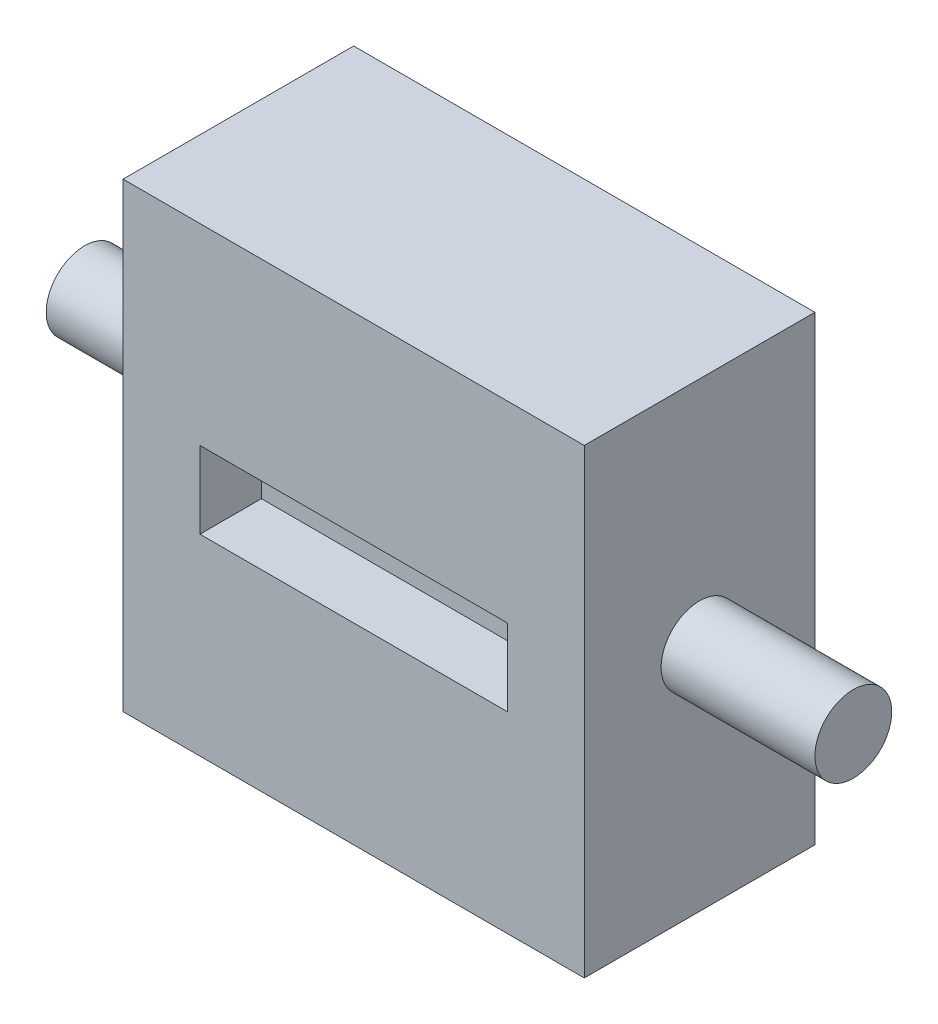
ISO-10303-21;
HEADER;
FILE_DESCRIPTION(('STEP AP214'),'2;1');
FILE_NAME('part.step','',(''),(''),'','','');
FILE_SCHEMA(('AUTOMOTIVE_DESIGN { 1 0 10303 214 1 1 1 1 }'));
ENDSEC;
DATA;
#1=APPLICATION_CONTEXT('core data for automotive mechanical design processes');
#2=APPLICATION_PROTOCOL_DEFINITION('international standard','automotive_design',2000,#1);
#3=PRODUCT_CONTEXT('',#1,'mechanical');
#4=PRODUCT('Part','Part','',(#3));
#5=PRODUCT_RELATED_PRODUCT_CATEGORY('part','',(#4));
#6=PRODUCT_DEFINITION_FORMATION('','',#4);
#7=PRODUCT_DEFINITION_CONTEXT('part definition',#1,'design');
#8=PRODUCT_DEFINITION('design','',#6,#7);
#9=PRODUCT_DEFINITION_SHAPE('','',#8);
#10=(LENGTH_UNIT() NAMED_UNIT(*) SI_UNIT(.MILLI.,.METRE.));
#11=(NAMED_UNIT(*) PLANE_ANGLE_UNIT() SI_UNIT($,.RADIAN.));
#12=(NAMED_UNIT(*) SI_UNIT($,.STERADIAN.) SOLID_ANGLE_UNIT());
#13=UNCERTAINTY_MEASURE_WITH_UNIT(LENGTH_MEASURE(1.E-05),#10,'distance_accuracy_value','');
#14=(GEOMETRIC_REPRESENTATION_CONTEXT(3) GLOBAL_UNCERTAINTY_ASSIGNED_CONTEXT((#13)) GLOBAL_UNIT_ASSIGNED_CONTEXT((#10,
#11,#12)) REPRESENTATION_CONTEXT('',''));
#15=CARTESIAN_POINT('',(0.,0.,0.));
#16=DIRECTION('',(0.,0.,1.));
#17=DIRECTION('',(1.,0.,0.));
#18=AXIS2_PLACEMENT_3D('',#15,#16,#17);
#19=CARTESIAN_POINT('',(19.05,-19.05,9.525));
#20=DIRECTION('',(-1.,0.,0.));
#21=DIRECTION('',(0.,0.,1.));
#22=AXIS2_PLACEMENT_3D('',#19,#20,#21);
#23=PLANE('',#22);
#24=CARTESIAN_POINT('',(19.05,0.,0.));
#25=DIRECTION('',(1.,0.,0.));
#26=DIRECTION('',(0.,0.,-1.));
#27=AXIS2_PLACEMENT_3D('',#24,#25,#26);
#28=CIRCLE('',#27,3.175);
#29=CARTESIAN_POINT('',(19.05,0.,-3.175));
#30=VERTEX_POINT('',#29);
#31=EDGE_CURVE('E11',#30,#30,#28,.T.);
#32=ORIENTED_EDGE('',*,*,#31,.F.);
#33=EDGE_LOOP('',(#32));
#34=FACE_BOUND('',#33,.T.);
#35=DIRECTION('',(0.,1.,0.));
#36=VECTOR('',#35,1.);
#37=CARTESIAN_POINT('',(19.05,-19.05,-9.525));
#38=LINE('',#37,#36);
#39=CARTESIAN_POINT('',(19.05,-19.05,-9.525));
#40=VERTEX_POINT('',#39);
#41=CARTESIAN_POINT('',(19.05,19.05,-9.525));
#42=VERTEX_POINT('',#41);
#43=EDGE_CURVE('E353',#40,#42,#38,.T.);
#44=ORIENTED_EDGE('',*,*,#43,.T.);
#45=DIRECTION('',(0.,0.,-1.));
#46=VECTOR('',#45,1.);
#47=CARTESIAN_POINT('',(19.05,19.05,9.525));
#48=LINE('',#47,#46);
#49=CARTESIAN_POINT('',(19.05,19.05,9.525));
#50=VERTEX_POINT('',#49);
#51=EDGE_CURVE('E44',#50,#42,#48,.T.);
#52=ORIENTED_EDGE('',*,*,#51,.F.);
#53=DIRECTION('',(0.,1.,0.));
#54=VECTOR('',#53,1.);
#55=CARTESIAN_POINT('',(19.05,-19.05,9.525));
#56=LINE('',#55,#54);
#57=CARTESIAN_POINT('',(19.05,-19.05,9.525));
#58=VERTEX_POINT('',#57);
#59=EDGE_CURVE('E362',#58,#50,#56,.T.);
#60=ORIENTED_EDGE('',*,*,#59,.F.);
#61=DIRECTION('',(0.,0.,-1.));
#62=VECTOR('',#61,1.);
#63=CARTESIAN_POINT('',(19.05,-19.05,9.525));
#64=LINE('',#63,#62);
#65=EDGE_CURVE('E376',#58,#40,#64,.T.);
#66=ORIENTED_EDGE('',*,*,#65,.T.);
#67=EDGE_LOOP('',(#44,#52,#60,#66));
#68=FACE_BOUND('',#67,.T.);
#69=ADVANCED_FACE('F41',(#34,#68),#23,.F.);
#70=CARTESIAN_POINT('',(-19.05,19.05,9.525));
#71=DIRECTION('',(0.,-1.,0.));
#72=DIRECTION('',(0.,0.,-1.));
#73=AXIS2_PLACEMENT_3D('',#70,#71,#72);
#74=PLANE('',#73);
#75=DIRECTION('',(-1.,0.,0.));
#76=VECTOR('',#75,1.);
#77=CARTESIAN_POINT('',(-19.05,19.05,-9.525));
#78=LINE('',#77,#76);
#79=CARTESIAN_POINT('',(-19.05,19.05,-9.525));
#80=VERTEX_POINT('',#79);
#81=EDGE_CURVE('E380',#42,#80,#78,.T.);
#82=ORIENTED_EDGE('',*,*,#81,.T.);
#83=DIRECTION('',(0.,0.,-1.));
#84=VECTOR('',#83,1.);
#85=CARTESIAN_POINT('',(-19.05,19.05,9.525));
#86=LINE('',#85,#84);
#87=CARTESIAN_POINT('',(-19.05,19.05,9.525));
#88=VERTEX_POINT('',#87);
#89=EDGE_CURVE('E394',#88,#80,#86,.T.);
#90=ORIENTED_EDGE('',*,*,#89,.F.);
#91=DIRECTION('',(-1.,0.,0.));
#92=VECTOR('',#91,1.);
#93=CARTESIAN_POINT('',(-19.05,19.05,9.525));
#94=LINE('',#93,#92);
#95=EDGE_CURVE('E366',#50,#88,#94,.T.);
#96=ORIENTED_EDGE('',*,*,#95,.F.);
#97=ORIENTED_EDGE('',*,*,#51,.T.);
#98=EDGE_LOOP('',(#82,#90,#96,#97));
#99=FACE_BOUND('',#98,.T.);
#100=ADVANCED_FACE('F405',(#99),#74,.F.);
#101=CARTESIAN_POINT('',(-19.05,-19.05,9.525));
#102=DIRECTION('',(1.,0.,0.));
#103=DIRECTION('',(0.,0.,-1.));
#104=AXIS2_PLACEMENT_3D('',#101,#102,#103);
#105=PLANE('',#104);
#106=CARTESIAN_POINT('',(-19.05,0.,0.));
#107=DIRECTION('',(1.,0.,0.));
#108=DIRECTION('',(0.,0.,-1.));
#109=AXIS2_PLACEMENT_3D('',#106,#107,#108);
#110=CIRCLE('',#109,3.175);
#111=CARTESIAN_POINT('',(-19.05,0.,-3.175));
#112=VERTEX_POINT('',#111);
#113=EDGE_CURVE('E641',#112,#112,#110,.T.);
#114=ORIENTED_EDGE('',*,*,#113,.T.);
#115=EDGE_LOOP('',(#114));
#116=FACE_BOUND('',#115,.T.);
#117=DIRECTION('',(0.,-1.,0.));
#118=VECTOR('',#117,1.);
#119=CARTESIAN_POINT('',(-19.05,-19.05,-9.525));
#120=LINE('',#119,#118);
#121=CARTESIAN_POINT('',(-19.05,-19.05,-9.525));
#122=VERTEX_POINT('',#121);
#123=EDGE_CURVE('E383',#80,#122,#120,.T.);
#124=ORIENTED_EDGE('',*,*,#123,.T.);
#125=DIRECTION('',(0.,0.,-1.));
#126=VECTOR('',#125,1.);
#127=CARTESIAN_POINT('',(-19.05,-19.05,9.525));
#128=LINE('',#127,#126);
#129=CARTESIAN_POINT('',(-19.05,-19.05,9.525));
#130=VERTEX_POINT('',#129);
#131=EDGE_CURVE('E391',#130,#122,#128,.T.);
#132=ORIENTED_EDGE('',*,*,#131,.F.);
#133=DIRECTION('',(0.,-1.,0.));
#134=VECTOR('',#133,1.);
#135=CARTESIAN_POINT('',(-19.05,-19.05,9.525));
#136=LINE('',#135,#134);
#137=EDGE_CURVE('E370',#88,#130,#136,.T.);
#138=ORIENTED_EDGE('',*,*,#137,.F.);
#139=ORIENTED_EDGE('',*,*,#89,.T.);
#140=EDGE_LOOP('',(#124,#132,#138,#139));
#141=FACE_BOUND('',#140,.T.);
#142=ADVANCED_FACE('F414',(#116,#141),#105,.F.);
#143=CARTESIAN_POINT('',(-19.05,-19.05,9.525));
#144=DIRECTION('',(0.,1.,0.));
#145=DIRECTION('',(0.,0.,1.));
#146=AXIS2_PLACEMENT_3D('',#143,#144,#145);
#147=PLANE('',#146);
#148=DIRECTION('',(1.,0.,0.));
#149=VECTOR('',#148,1.);
#150=CARTESIAN_POINT('',(-19.05,-19.05,-9.525));
#151=LINE('',#150,#149);
#152=EDGE_CURVE('E367',#122,#40,#151,.T.);
#153=ORIENTED_EDGE('',*,*,#152,.T.);
#154=ORIENTED_EDGE('',*,*,#65,.F.);
#155=DIRECTION('',(1.,0.,0.));
#156=VECTOR('',#155,1.);
#157=CARTESIAN_POINT('',(-19.05,-19.05,9.525));
#158=LINE('',#157,#156);
#159=EDGE_CURVE('E373',#130,#58,#158,.T.);
#160=ORIENTED_EDGE('',*,*,#159,.F.);
#161=ORIENTED_EDGE('',*,*,#131,.T.);
#162=EDGE_LOOP('',(#153,#154,#160,#161));
#163=FACE_BOUND('',#162,.T.);
#164=ADVANCED_FACE('F417',(#163),#147,.F.);
#165=CARTESIAN_POINT('',(0.,0.,9.525));
#166=DIRECTION('',(0.,0.,-1.));
#167=DIRECTION('',(-1.,0.,0.));
#168=AXIS2_PLACEMENT_3D('',#165,#166,#167);
#169=PLANE('',#168);
#170=DIRECTION('',(-1.,0.,0.));
#171=VECTOR('',#170,1.);
#172=CARTESIAN_POINT('',(-12.7,3.175,9.525));
#173=LINE('',#172,#171);
#174=CARTESIAN_POINT('',(12.7,3.175,9.525));
#175=VERTEX_POINT('',#174);
#176=CARTESIAN_POINT('',(-12.7,3.175,9.525));
#177=VERTEX_POINT('',#176);
#178=EDGE_CURVE('E339',#175,#177,#173,.T.);
#179=ORIENTED_EDGE('',*,*,#178,.F.);
#180=DIRECTION('',(0.,1.,0.));
#181=VECTOR('',#180,1.);
#182=CARTESIAN_POINT('',(12.7,3.175,9.525));
#183=LINE('',#182,#181);
#184=CARTESIAN_POINT('',(12.7,-3.175,9.525));
#185=VERTEX_POINT('',#184);
#186=EDGE_CURVE('E65',#185,#175,#183,.T.);
#187=ORIENTED_EDGE('',*,*,#186,.F.);
#188=DIRECTION('',(1.,0.,0.));
#189=VECTOR('',#188,1.);
#190=CARTESIAN_POINT('',(-12.7,-3.175,9.525));
#191=LINE('',#190,#189);
#192=CARTESIAN_POINT('',(-12.7,-3.175,9.525));
#193=VERTEX_POINT('',#192);
#194=EDGE_CURVE('E324',#193,#185,#191,.T.);
#195=ORIENTED_EDGE('',*,*,#194,.F.);
#196=DIRECTION('',(0.,-1.,0.));
#197=VECTOR('',#196,1.);
#198=CARTESIAN_POINT('',(-12.7,3.175,9.525));
#199=LINE('',#198,#197);
#200=EDGE_CURVE('E343',#177,#193,#199,.T.);
#201=ORIENTED_EDGE('',*,*,#200,.F.);
#202=EDGE_LOOP('',(#179,#187,#195,#201));
#203=FACE_BOUND('',#202,.T.);
#204=ORIENTED_EDGE('',*,*,#59,.T.);
#205=ORIENTED_EDGE('',*,*,#95,.T.);
#206=ORIENTED_EDGE('',*,*,#137,.T.);
#207=ORIENTED_EDGE('',*,*,#159,.T.);
#208=EDGE_LOOP('',(#204,#205,#206,#207));
#209=FACE_BOUND('',#208,.T.);
#210=ADVANCED_FACE('F419',(#203,#209),#169,.F.);
#211=CARTESIAN_POINT('',(0.,0.,-9.525));
#212=DIRECTION('',(0.,0.,-1.));
#213=DIRECTION('',(-1.,0.,0.));
#214=AXIS2_PLACEMENT_3D('',#211,#212,#213);
#215=PLANE('',#214);
#216=DIRECTION('',(0.,-1.,0.));
#217=VECTOR('',#216,1.);
#218=CARTESIAN_POINT('',(3.175,9.525,-9.525));
#219=LINE('',#218,#217);
#220=CARTESIAN_POINT('',(3.175,9.525,-9.525));
#221=VERTEX_POINT('',#220);
#222=CARTESIAN_POINT('',(3.175,3.175,-9.525));
#223=VERTEX_POINT('',#222);
#224=EDGE_CURVE('E57',#221,#223,#219,.T.);
#225=ORIENTED_EDGE('',*,*,#224,.F.);
#226=DIRECTION('',(1.,0.,0.));
#227=VECTOR('',#226,1.);
#228=CARTESIAN_POINT('',(3.175,9.525,-9.525));
#229=LINE('',#228,#227);
#230=CARTESIAN_POINT('',(-3.175,9.525,-9.525));
#231=VERTEX_POINT('',#230);
#232=EDGE_CURVE('E203',#231,#221,#229,.T.);
#233=ORIENTED_EDGE('',*,*,#232,.F.);
#234=DIRECTION('',(0.,1.,0.));
#235=VECTOR('',#234,1.);
#236=CARTESIAN_POINT('',(-3.175,9.525,-9.525));
#237=LINE('',#236,#235);
#238=CARTESIAN_POINT('',(-3.175,3.175,-9.525));
#239=VERTEX_POINT('',#238);
#240=EDGE_CURVE('E207',#239,#231,#237,.T.);
#241=ORIENTED_EDGE('',*,*,#240,.F.);
#242=DIRECTION('',(1.,0.,0.));
#243=VECTOR('',#242,1.);
#244=CARTESIAN_POINT('',(-3.175,3.175,-9.525));
#245=LINE('',#244,#243);
#246=CARTESIAN_POINT('',(-9.525,3.175,-9.525));
#247=VERTEX_POINT('',#246);
#248=EDGE_CURVE('E280',#247,#239,#245,.T.);
#249=ORIENTED_EDGE('',*,*,#248,.F.);
#250=DIRECTION('',(0.,1.,0.));
#251=VECTOR('',#250,1.);
#252=CARTESIAN_POINT('',(-9.525,3.175,-9.525));
#253=LINE('',#252,#251);
#254=CARTESIAN_POINT('',(-9.525,-3.175,-9.525));
#255=VERTEX_POINT('',#254);
#256=EDGE_CURVE('E276',#255,#247,#253,.T.);
#257=ORIENTED_EDGE('',*,*,#256,.F.);
#258=DIRECTION('',(-1.,0.,0.));
#259=VECTOR('',#258,1.);
#260=CARTESIAN_POINT('',(-3.175,-3.175,-9.525));
#261=LINE('',#260,#259);
#262=CARTESIAN_POINT('',(-3.175,-3.175,-9.525));
#263=VERTEX_POINT('',#262);
#264=EDGE_CURVE('E272',#263,#255,#261,.T.);
#265=ORIENTED_EDGE('',*,*,#264,.F.);
#266=DIRECTION('',(0.,1.,0.));
#267=VECTOR('',#266,1.);
#268=CARTESIAN_POINT('',(-3.175,-3.175,-9.525));
#269=LINE('',#268,#267);
#270=CARTESIAN_POINT('',(-3.175,-9.525,-9.525));
#271=VERTEX_POINT('',#270);
#272=EDGE_CURVE('E268',#271,#263,#269,.T.);
#273=ORIENTED_EDGE('',*,*,#272,.F.);
#274=DIRECTION('',(-1.,0.,0.));
#275=VECTOR('',#274,1.);
#276=CARTESIAN_POINT('',(3.175,-9.525,-9.525));
#277=LINE('',#276,#275);
#278=CARTESIAN_POINT('',(3.175,-9.525,-9.525));
#279=VERTEX_POINT('',#278);
#280=EDGE_CURVE('E264',#279,#271,#277,.T.);
#281=ORIENTED_EDGE('',*,*,#280,.F.);
#282=DIRECTION('',(0.,-1.,0.));
#283=VECTOR('',#282,1.);
#284=CARTESIAN_POINT('',(3.175,-3.175,-9.525));
#285=LINE('',#284,#283);
#286=CARTESIAN_POINT('',(3.175,-3.175,-9.525));
#287=VERTEX_POINT('',#286);
#288=EDGE_CURVE('E260',#287,#279,#285,.T.);
#289=ORIENTED_EDGE('',*,*,#288,.F.);
#290=DIRECTION('',(-1.,0.,0.));
#291=VECTOR('',#290,1.);
#292=CARTESIAN_POINT('',(9.525,-3.175,-9.525));
#293=LINE('',#292,#291);
#294=CARTESIAN_POINT('',(9.525,-3.175,-9.525));
#295=VERTEX_POINT('',#294);
#296=EDGE_CURVE('E256',#295,#287,#293,.T.);
#297=ORIENTED_EDGE('',*,*,#296,.F.);
#298=DIRECTION('',(0.,-1.,0.));
#299=VECTOR('',#298,1.);
#300=CARTESIAN_POINT('',(9.525,3.175,-9.525));
#301=LINE('',#300,#299);
#302=CARTESIAN_POINT('',(9.525,3.175,-9.525));
#303=VERTEX_POINT('',#302);
#304=EDGE_CURVE('E252',#303,#295,#301,.T.);
#305=ORIENTED_EDGE('',*,*,#304,.F.);
#306=DIRECTION('',(1.,0.,0.));
#307=VECTOR('',#306,1.);
#308=CARTESIAN_POINT('',(9.525,3.175,-9.525));
#309=LINE('',#308,#307);
#310=EDGE_CURVE('E248',#223,#303,#309,.T.);
#311=ORIENTED_EDGE('',*,*,#310,.F.);
#312=EDGE_LOOP('',(#225,#233,#241,#249,#257,#265,#273,#281,#289,#297,#305,#311));
#313=FACE_BOUND('',#312,.T.);
#314=ORIENTED_EDGE('',*,*,#43,.F.);
#315=ORIENTED_EDGE('',*,*,#152,.F.);
#316=ORIENTED_EDGE('',*,*,#123,.F.);
#317=ORIENTED_EDGE('',*,*,#81,.F.);
#318=EDGE_LOOP('',(#314,#315,#316,#317));
#319=FACE_BOUND('',#318,.T.);
#320=ADVANCED_FACE('F412',(#313,#319),#215,.T.);
#321=CARTESIAN_POINT('',(12.7,3.175,4.445));
#322=DIRECTION('',(1.,0.,0.));
#323=DIRECTION('',(0.,0.,-1.));
#324=AXIS2_PLACEMENT_3D('',#321,#322,#323);
#325=PLANE('',#324);
#326=ORIENTED_EDGE('',*,*,#186,.T.);
#327=DIRECTION('',(0.,0.,1.));
#328=VECTOR('',#327,1.);
#329=CARTESIAN_POINT('',(12.7,3.175,4.445));
#330=LINE('',#329,#328);
#331=CARTESIAN_POINT('',(12.7,3.175,4.445));
#332=VERTEX_POINT('',#331);
#333=EDGE_CURVE('E336',#332,#175,#330,.T.);
#334=ORIENTED_EDGE('',*,*,#333,.F.);
#335=DIRECTION('',(0.,1.,0.));
#336=VECTOR('',#335,1.);
#337=CARTESIAN_POINT('',(12.7,3.175,4.445));
#338=LINE('',#337,#336);
#339=CARTESIAN_POINT('',(12.7,-3.175,4.445));
#340=VERTEX_POINT('',#339);
#341=EDGE_CURVE('E319',#340,#332,#338,.T.);
#342=ORIENTED_EDGE('',*,*,#341,.F.);
#343=DIRECTION('',(0.,0.,1.));
#344=VECTOR('',#343,1.);
#345=CARTESIAN_POINT('',(12.7,-3.175,4.445));
#346=LINE('',#345,#344);
#347=EDGE_CURVE('E350',#340,#185,#346,.T.);
#348=ORIENTED_EDGE('',*,*,#347,.T.);
#349=EDGE_LOOP('',(#326,#334,#342,#348));
#350=FACE_BOUND('',#349,.T.);
#351=ADVANCED_FACE('F427',(#350),#325,.F.);
#352=CARTESIAN_POINT('',(-12.7,-3.175,4.445));
#353=DIRECTION('',(0.,-1.,0.));
#354=DIRECTION('',(0.,0.,-1.));
#355=AXIS2_PLACEMENT_3D('',#352,#353,#354);
#356=PLANE('',#355);
#357=ORIENTED_EDGE('',*,*,#194,.T.);
#358=ORIENTED_EDGE('',*,*,#347,.F.);
#359=DIRECTION('',(1.,0.,0.));
#360=VECTOR('',#359,1.);
#361=CARTESIAN_POINT('',(-12.7,-3.175,4.445));
#362=LINE('',#361,#360);
#363=CARTESIAN_POINT('',(-12.7,-3.175,4.445));
#364=VERTEX_POINT('',#363);
#365=EDGE_CURVE('E332',#364,#340,#362,.T.);
#366=ORIENTED_EDGE('',*,*,#365,.F.);
#367=DIRECTION('',(0.,0.,1.));
#368=VECTOR('',#367,1.);
#369=CARTESIAN_POINT('',(-12.7,-3.175,4.445));
#370=LINE('',#369,#368);
#371=EDGE_CURVE('E354',#364,#193,#370,.T.);
#372=ORIENTED_EDGE('',*,*,#371,.T.);
#373=EDGE_LOOP('',(#357,#358,#366,#372));
#374=FACE_BOUND('',#373,.T.);
#375=ADVANCED_FACE('F505',(#374),#356,.F.);
#376=CARTESIAN_POINT('',(-12.7,3.175,4.445));
#377=DIRECTION('',(-1.,0.,0.));
#378=DIRECTION('',(0.,0.,1.));
#379=AXIS2_PLACEMENT_3D('',#376,#377,#378);
#380=PLANE('',#379);
#381=ORIENTED_EDGE('',*,*,#200,.T.);
#382=ORIENTED_EDGE('',*,*,#371,.F.);
#383=DIRECTION('',(0.,-1.,0.));
#384=VECTOR('',#383,1.);
#385=CARTESIAN_POINT('',(-12.7,3.175,4.445));
#386=LINE('',#385,#384);
#387=CARTESIAN_POINT('',(-12.7,3.175,4.445));
#388=VERTEX_POINT('',#387);
#389=EDGE_CURVE('E328',#388,#364,#386,.T.);
#390=ORIENTED_EDGE('',*,*,#389,.F.);
#391=DIRECTION('',(0.,0.,1.));
#392=VECTOR('',#391,1.);
#393=CARTESIAN_POINT('',(-12.7,3.175,4.445));
#394=LINE('',#393,#392);
#395=EDGE_CURVE('E357',#388,#177,#394,.T.);
#396=ORIENTED_EDGE('',*,*,#395,.T.);
#397=EDGE_LOOP('',(#381,#382,#390,#396));
#398=FACE_BOUND('',#397,.T.);
#399=ADVANCED_FACE('F508',(#398),#380,.F.);
#400=CARTESIAN_POINT('',(-12.7,3.175,4.445));
#401=DIRECTION('',(0.,1.,0.));
#402=DIRECTION('',(0.,0.,1.));
#403=AXIS2_PLACEMENT_3D('',#400,#401,#402);
#404=PLANE('',#403);
#405=ORIENTED_EDGE('',*,*,#178,.T.);
#406=ORIENTED_EDGE('',*,*,#395,.F.);
#407=DIRECTION('',(-1.,0.,0.));
#408=VECTOR('',#407,1.);
#409=CARTESIAN_POINT('',(-12.7,3.175,4.445));
#410=LINE('',#409,#408);
#411=EDGE_CURVE('E323',#332,#388,#410,.T.);
#412=ORIENTED_EDGE('',*,*,#411,.F.);
#413=ORIENTED_EDGE('',*,*,#333,.T.);
#414=EDGE_LOOP('',(#405,#406,#412,#413));
#415=FACE_BOUND('',#414,.T.);
#416=ADVANCED_FACE('F503',(#415),#404,.F.);
#417=CARTESIAN_POINT('',(0.,0.,4.445));
#418=DIRECTION('',(0.,0.,1.));
#419=DIRECTION('',(1.,0.,0.));
#420=AXIS2_PLACEMENT_3D('',#417,#418,#419);
#421=PLANE('',#420);
#422=ORIENTED_EDGE('',*,*,#341,.T.);
#423=ORIENTED_EDGE('',*,*,#411,.T.);
#424=ORIENTED_EDGE('',*,*,#389,.T.);
#425=ORIENTED_EDGE('',*,*,#365,.T.);
#426=EDGE_LOOP('',(#422,#423,#424,#425));
#427=FACE_BOUND('',#426,.T.);
#428=ADVANCED_FACE('F500',(#427),#421,.T.);
#429=CARTESIAN_POINT('',(3.175,9.525,-4.445));
#430=DIRECTION('',(1.,0.,0.));
#431=DIRECTION('',(0.,1.,0.));
#432=AXIS2_PLACEMENT_3D('',#429,#430,#431);
#433=PLANE('',#432);
#434=ORIENTED_EDGE('',*,*,#224,.T.);
#435=DIRECTION('',(0.,0.,-1.));
#436=VECTOR('',#435,1.);
#437=CARTESIAN_POINT('',(3.175,3.175,-4.445));
#438=LINE('',#437,#436);
#439=CARTESIAN_POINT('',(3.175,3.175,-4.445));
#440=VERTEX_POINT('',#439);
#441=EDGE_CURVE('E177',#440,#223,#438,.T.);
#442=ORIENTED_EDGE('',*,*,#441,.F.);
#443=DIRECTION('',(0.,-1.,0.));
#444=VECTOR('',#443,1.);
#445=CARTESIAN_POINT('',(3.175,9.525,-4.445));
#446=LINE('',#445,#444);
#447=CARTESIAN_POINT('',(3.175,9.525,-4.445));
#448=VERTEX_POINT('',#447);
#449=EDGE_CURVE('E181',#448,#440,#446,.T.);
#450=ORIENTED_EDGE('',*,*,#449,.F.);
#451=DIRECTION('',(0.,0.,-1.));
#452=VECTOR('',#451,1.);
#453=CARTESIAN_POINT('',(3.175,9.525,-4.445));
#454=LINE('',#453,#452);
#455=EDGE_CURVE('E287',#448,#221,#454,.T.);
#456=ORIENTED_EDGE('',*,*,#455,.T.);
#457=EDGE_LOOP('',(#434,#442,#450,#456));
#458=FACE_BOUND('',#457,.T.);
#459=ADVANCED_FACE('F179',(#458),#433,.F.);
#460=CARTESIAN_POINT('',(3.175,9.525,-4.445));
#461=DIRECTION('',(0.,1.,0.));
#462=DIRECTION('',(0.,0.,1.));
#463=AXIS2_PLACEMENT_3D('',#460,#461,#462);
#464=PLANE('',#463);
#465=ORIENTED_EDGE('',*,*,#232,.T.);
#466=ORIENTED_EDGE('',*,*,#455,.F.);
#467=DIRECTION('',(1.,0.,0.));
#468=VECTOR('',#467,1.);
#469=CARTESIAN_POINT('',(3.175,9.525,-4.445));
#470=LINE('',#469,#468);
#471=CARTESIAN_POINT('',(-3.175,9.525,-4.445));
#472=VERTEX_POINT('',#471);
#473=EDGE_CURVE('E188',#472,#448,#470,.T.);
#474=ORIENTED_EDGE('',*,*,#473,.F.);
#475=DIRECTION('',(0.,0.,-1.));
#476=VECTOR('',#475,1.);
#477=CARTESIAN_POINT('',(-3.175,9.525,-4.445));
#478=LINE('',#477,#476);
#479=EDGE_CURVE('E290',#472,#231,#478,.T.);
#480=ORIENTED_EDGE('',*,*,#479,.T.);
#481=EDGE_LOOP('',(#465,#466,#474,#480));
#482=FACE_BOUND('',#481,.T.);
#483=ADVANCED_FACE('F456',(#482),#464,.F.);
#484=CARTESIAN_POINT('',(-3.175,9.525,-4.445));
#485=DIRECTION('',(-1.,0.,0.));
#486=DIRECTION('',(0.,-1.,0.));
#487=AXIS2_PLACEMENT_3D('',#484,#485,#486);
#488=PLANE('',#487);
#489=ORIENTED_EDGE('',*,*,#240,.T.);
#490=ORIENTED_EDGE('',*,*,#479,.F.);
#491=DIRECTION('',(0.,1.,0.));
#492=VECTOR('',#491,1.);
#493=CARTESIAN_POINT('',(-3.175,9.525,-4.445));
#494=LINE('',#493,#492);
#495=CARTESIAN_POINT('',(-3.175,3.175,-4.445));
#496=VERTEX_POINT('',#495);
#497=EDGE_CURVE('E241',#496,#472,#494,.T.);
#498=ORIENTED_EDGE('',*,*,#497,.F.);
#499=DIRECTION('',(0.,0.,-1.));
#500=VECTOR('',#499,1.);
#501=CARTESIAN_POINT('',(-3.175,3.175,-4.445));
#502=LINE('',#501,#500);
#503=EDGE_CURVE('E293',#496,#239,#502,.T.);
#504=ORIENTED_EDGE('',*,*,#503,.T.);
#505=EDGE_LOOP('',(#489,#490,#498,#504));
#506=FACE_BOUND('',#505,.T.);
#507=ADVANCED_FACE('F459',(#506),#488,.F.);
#508=CARTESIAN_POINT('',(-3.175,3.175,-4.445));
#509=DIRECTION('',(0.,1.,0.));
#510=DIRECTION('',(-1.,0.,0.));
#511=AXIS2_PLACEMENT_3D('',#508,#509,#510);
#512=PLANE('',#511);
#513=ORIENTED_EDGE('',*,*,#248,.T.);
#514=ORIENTED_EDGE('',*,*,#503,.F.);
#515=DIRECTION('',(1.,0.,0.));
#516=VECTOR('',#515,1.);
#517=CARTESIAN_POINT('',(-3.175,3.175,-4.445));
#518=LINE('',#517,#516);
#519=CARTESIAN_POINT('',(-9.525,3.175,-4.445));
#520=VERTEX_POINT('',#519);
#521=EDGE_CURVE('E237',#520,#496,#518,.T.);
#522=ORIENTED_EDGE('',*,*,#521,.F.);
#523=DIRECTION('',(0.,0.,-1.));
#524=VECTOR('',#523,1.);
#525=CARTESIAN_POINT('',(-9.525,3.175,-4.445));
#526=LINE('',#525,#524);
#527=EDGE_CURVE('E296',#520,#247,#526,.T.);
#528=ORIENTED_EDGE('',*,*,#527,.T.);
#529=EDGE_LOOP('',(#513,#514,#522,#528));
#530=FACE_BOUND('',#529,.T.);
#531=ADVANCED_FACE('F463',(#530),#512,.F.);
#532=CARTESIAN_POINT('',(-9.525,3.175,-4.445));
#533=DIRECTION('',(-1.,0.,0.));
#534=DIRECTION('',(0.,-1.,0.));
#535=AXIS2_PLACEMENT_3D('',#532,#533,#534);
#536=PLANE('',#535);
#537=ORIENTED_EDGE('',*,*,#256,.T.);
#538=ORIENTED_EDGE('',*,*,#527,.F.);
#539=DIRECTION('',(0.,1.,0.));
#540=VECTOR('',#539,1.);
#541=CARTESIAN_POINT('',(-9.525,3.175,-4.445));
#542=LINE('',#541,#540);
#543=CARTESIAN_POINT('',(-9.525,-3.175,-4.445));
#544=VERTEX_POINT('',#543);
#545=EDGE_CURVE('E233',#544,#520,#542,.T.);
#546=ORIENTED_EDGE('',*,*,#545,.F.);
#547=DIRECTION('',(0.,0.,-1.));
#548=VECTOR('',#547,1.);
#549=CARTESIAN_POINT('',(-9.525,-3.175,-4.445));
#550=LINE('',#549,#548);
#551=EDGE_CURVE('E299',#544,#255,#550,.T.);
#552=ORIENTED_EDGE('',*,*,#551,.T.);
#553=EDGE_LOOP('',(#537,#538,#546,#552));
#554=FACE_BOUND('',#553,.T.);
#555=ADVANCED_FACE('F467',(#554),#536,.F.);
#556=CARTESIAN_POINT('',(-3.175,-3.175,-4.445));
#557=DIRECTION('',(0.,-1.,0.));
#558=DIRECTION('',(1.,0.,0.));
#559=AXIS2_PLACEMENT_3D('',#556,#557,#558);
#560=PLANE('',#559);
#561=ORIENTED_EDGE('',*,*,#264,.T.);
#562=ORIENTED_EDGE('',*,*,#551,.F.);
#563=DIRECTION('',(-1.,0.,0.));
#564=VECTOR('',#563,1.);
#565=CARTESIAN_POINT('',(-3.175,-3.175,-4.445));
#566=LINE('',#565,#564);
#567=CARTESIAN_POINT('',(-3.175,-3.175,-4.445));
#568=VERTEX_POINT('',#567);
#569=EDGE_CURVE('E229',#568,#544,#566,.T.);
#570=ORIENTED_EDGE('',*,*,#569,.F.);
#571=DIRECTION('',(0.,0.,-1.));
#572=VECTOR('',#571,1.);
#573=CARTESIAN_POINT('',(-3.175,-3.175,-4.445));
#574=LINE('',#573,#572);
#575=EDGE_CURVE('E302',#568,#263,#574,.T.);
#576=ORIENTED_EDGE('',*,*,#575,.T.);
#577=EDGE_LOOP('',(#561,#562,#570,#576));
#578=FACE_BOUND('',#577,.T.);
#579=ADVANCED_FACE('F471',(#578),#560,.F.);
#580=CARTESIAN_POINT('',(-3.175,-3.175,-4.445));
#581=DIRECTION('',(-1.,0.,0.));
#582=DIRECTION('',(0.,-1.,0.));
#583=AXIS2_PLACEMENT_3D('',#580,#581,#582);
#584=PLANE('',#583);
#585=ORIENTED_EDGE('',*,*,#272,.T.);
#586=ORIENTED_EDGE('',*,*,#575,.F.);
#587=DIRECTION('',(0.,1.,0.));
#588=VECTOR('',#587,1.);
#589=CARTESIAN_POINT('',(-3.175,-3.175,-4.445));
#590=LINE('',#589,#588);
#591=CARTESIAN_POINT('',(-3.175,-9.525,-4.445));
#592=VERTEX_POINT('',#591);
#593=EDGE_CURVE('E225',#592,#568,#590,.T.);
#594=ORIENTED_EDGE('',*,*,#593,.F.);
#595=DIRECTION('',(0.,0.,-1.));
#596=VECTOR('',#595,1.);
#597=CARTESIAN_POINT('',(-3.175,-9.525,-4.445));
#598=LINE('',#597,#596);
#599=EDGE_CURVE('E305',#592,#271,#598,.T.);
#600=ORIENTED_EDGE('',*,*,#599,.T.);
#601=EDGE_LOOP('',(#585,#586,#594,#600));
#602=FACE_BOUND('',#601,.T.);
#603=ADVANCED_FACE('F475',(#602),#584,.F.);
#604=CARTESIAN_POINT('',(3.175,-9.525,-4.445));
#605=DIRECTION('',(0.,-1.,0.));
#606=DIRECTION('',(0.,0.,-1.));
#607=AXIS2_PLACEMENT_3D('',#604,#605,#606);
#608=PLANE('',#607);
#609=ORIENTED_EDGE('',*,*,#280,.T.);
#610=ORIENTED_EDGE('',*,*,#599,.F.);
#611=DIRECTION('',(-1.,0.,0.));
#612=VECTOR('',#611,1.);
#613=CARTESIAN_POINT('',(3.175,-9.525,-4.445));
#614=LINE('',#613,#612);
#615=CARTESIAN_POINT('',(3.175,-9.525,-4.445));
#616=VERTEX_POINT('',#615);
#617=EDGE_CURVE('E221',#616,#592,#614,.T.);
#618=ORIENTED_EDGE('',*,*,#617,.F.);
#619=DIRECTION('',(0.,0.,-1.));
#620=VECTOR('',#619,1.);
#621=CARTESIAN_POINT('',(3.175,-9.525,-4.445));
#622=LINE('',#621,#620);
#623=EDGE_CURVE('E308',#616,#279,#622,.T.);
#624=ORIENTED_EDGE('',*,*,#623,.T.);
#625=EDGE_LOOP('',(#609,#610,#618,#624));
#626=FACE_BOUND('',#625,.T.);
#627=ADVANCED_FACE('F479',(#626),#608,.F.);
#628=CARTESIAN_POINT('',(3.175,-3.175,-4.445));
#629=DIRECTION('',(1.,0.,0.));
#630=DIRECTION('',(0.,0.,-1.));
#631=AXIS2_PLACEMENT_3D('',#628,#629,#630);
#632=PLANE('',#631);
#633=ORIENTED_EDGE('',*,*,#288,.T.);
#634=ORIENTED_EDGE('',*,*,#623,.F.);
#635=DIRECTION('',(0.,-1.,0.));
#636=VECTOR('',#635,1.);
#637=CARTESIAN_POINT('',(3.175,-3.175,-4.445));
#638=LINE('',#637,#636);
#639=CARTESIAN_POINT('',(3.175,-3.175,-4.445));
#640=VERTEX_POINT('',#639);
#641=EDGE_CURVE('E217',#640,#616,#638,.T.);
#642=ORIENTED_EDGE('',*,*,#641,.F.);
#643=DIRECTION('',(0.,0.,-1.));
#644=VECTOR('',#643,1.);
#645=CARTESIAN_POINT('',(3.175,-3.175,-4.445));
#646=LINE('',#645,#644);
#647=EDGE_CURVE('E311',#640,#287,#646,.T.);
#648=ORIENTED_EDGE('',*,*,#647,.T.);
#649=EDGE_LOOP('',(#633,#634,#642,#648));
#650=FACE_BOUND('',#649,.T.);
#651=ADVANCED_FACE('F483',(#650),#632,.F.);
#652=CARTESIAN_POINT('',(9.525,-3.175,-4.445));
#653=DIRECTION('',(0.,-1.,0.));
#654=DIRECTION('',(1.,0.,0.));
#655=AXIS2_PLACEMENT_3D('',#652,#653,#654);
#656=PLANE('',#655);
#657=ORIENTED_EDGE('',*,*,#296,.T.);
#658=ORIENTED_EDGE('',*,*,#647,.F.);
#659=DIRECTION('',(-1.,0.,0.));
#660=VECTOR('',#659,1.);
#661=CARTESIAN_POINT('',(9.525,-3.175,-4.445));
#662=LINE('',#661,#660);
#663=CARTESIAN_POINT('',(9.525,-3.175,-4.445));
#664=VERTEX_POINT('',#663);
#665=EDGE_CURVE('E213',#664,#640,#662,.T.);
#666=ORIENTED_EDGE('',*,*,#665,.F.);
#667=DIRECTION('',(0.,0.,-1.));
#668=VECTOR('',#667,1.);
#669=CARTESIAN_POINT('',(9.525,-3.175,-4.445));
#670=LINE('',#669,#668);
#671=EDGE_CURVE('E314',#664,#295,#670,.T.);
#672=ORIENTED_EDGE('',*,*,#671,.T.);
#673=EDGE_LOOP('',(#657,#658,#666,#672));
#674=FACE_BOUND('',#673,.T.);
#675=ADVANCED_FACE('F487',(#674),#656,.F.);
#676=CARTESIAN_POINT('',(9.525,3.175,-4.445));
#677=DIRECTION('',(1.,0.,0.));
#678=DIRECTION('',(0.,1.,0.));
#679=AXIS2_PLACEMENT_3D('',#676,#677,#678);
#680=PLANE('',#679);
#681=ORIENTED_EDGE('',*,*,#304,.T.);
#682=ORIENTED_EDGE('',*,*,#671,.F.);
#683=DIRECTION('',(0.,-1.,0.));
#684=VECTOR('',#683,1.);
#685=CARTESIAN_POINT('',(9.525,3.175,-4.445));
#686=LINE('',#685,#684);
#687=CARTESIAN_POINT('',(9.525,3.175,-4.445));
#688=VERTEX_POINT('',#687);
#689=EDGE_CURVE('E197',#688,#664,#686,.T.);
#690=ORIENTED_EDGE('',*,*,#689,.F.);
#691=DIRECTION('',(0.,0.,-1.));
#692=VECTOR('',#691,1.);
#693=CARTESIAN_POINT('',(9.525,3.175,-4.445));
#694=LINE('',#693,#692);
#695=EDGE_CURVE('E187',#688,#303,#694,.T.);
#696=ORIENTED_EDGE('',*,*,#695,.T.);
#697=EDGE_LOOP('',(#681,#682,#690,#696));
#698=FACE_BOUND('',#697,.T.);
#699=ADVANCED_FACE('F491',(#698),#680,.F.);
#700=CARTESIAN_POINT('',(9.525,3.175,-4.445));
#701=DIRECTION('',(0.,1.,0.));
#702=DIRECTION('',(-1.,0.,0.));
#703=AXIS2_PLACEMENT_3D('',#700,#701,#702);
#704=PLANE('',#703);
#705=ORIENTED_EDGE('',*,*,#310,.T.);
#706=ORIENTED_EDGE('',*,*,#695,.F.);
#707=DIRECTION('',(1.,0.,0.));
#708=VECTOR('',#707,1.);
#709=CARTESIAN_POINT('',(9.525,3.175,-4.445));
#710=LINE('',#709,#708);
#711=EDGE_CURVE('E191',#440,#688,#710,.T.);
#712=ORIENTED_EDGE('',*,*,#711,.F.);
#713=ORIENTED_EDGE('',*,*,#441,.T.);
#714=EDGE_LOOP('',(#705,#706,#712,#713));
#715=FACE_BOUND('',#714,.T.);
#716=ADVANCED_FACE('F192',(#715),#704,.F.);
#717=CARTESIAN_POINT('',(0.,0.,-4.445));
#718=DIRECTION('',(0.,0.,-1.));
#719=DIRECTION('',(-1.,0.,0.));
#720=AXIS2_PLACEMENT_3D('',#717,#718,#719);
#721=PLANE('',#720);
#722=ORIENTED_EDGE('',*,*,#449,.T.);
#723=ORIENTED_EDGE('',*,*,#711,.T.);
#724=ORIENTED_EDGE('',*,*,#689,.T.);
#725=ORIENTED_EDGE('',*,*,#665,.T.);
#726=ORIENTED_EDGE('',*,*,#641,.T.);
#727=ORIENTED_EDGE('',*,*,#617,.T.);
#728=ORIENTED_EDGE('',*,*,#593,.T.);
#729=ORIENTED_EDGE('',*,*,#569,.T.);
#730=ORIENTED_EDGE('',*,*,#545,.T.);
#731=ORIENTED_EDGE('',*,*,#521,.T.);
#732=ORIENTED_EDGE('',*,*,#497,.T.);
#733=ORIENTED_EDGE('',*,*,#473,.T.);
#734=EDGE_LOOP('',(#722,#723,#724,#725,#726,#727,#728,#729,#730,#731,#732,#733));
#735=FACE_BOUND('',#734,.T.);
#736=ADVANCED_FACE('F199',(#735),#721,.T.);
#737=CARTESIAN_POINT('',(31.75,0.,0.));
#738=DIRECTION('',(-1.,0.,0.));
#739=DIRECTION('',(0.,0.,1.));
#740=AXIS2_PLACEMENT_3D('',#737,#738,#739);
#741=CYLINDRICAL_SURFACE('',#740,3.175);
#742=CARTESIAN_POINT('',(31.75,0.,0.));
#743=DIRECTION('',(1.,0.,0.));
#744=DIRECTION('',(0.,0.,-1.));
#745=AXIS2_PLACEMENT_3D('',#742,#743,#744);
#746=CIRCLE('',#745,3.175);
#747=CARTESIAN_POINT('',(31.75,0.,-3.175));
#748=VERTEX_POINT('',#747);
#749=EDGE_CURVE('E249',#748,#748,#746,.T.);
#750=ORIENTED_EDGE('',*,*,#749,.F.);
#751=EDGE_LOOP('',(#750));
#752=FACE_BOUND('',#751,.T.);
#753=ORIENTED_EDGE('',*,*,#31,.T.);
#754=EDGE_LOOP('',(#753));
#755=FACE_BOUND('',#754,.T.);
#756=ADVANCED_FACE('F440',(#752,#755),#741,.T.);
#757=CARTESIAN_POINT('',(31.75,0.,0.));
#758=DIRECTION('',(1.,0.,0.));
#759=DIRECTION('',(0.,0.,-1.));
#760=AXIS2_PLACEMENT_3D('',#757,#758,#759);
#761=PLANE('',#760);
#762=ORIENTED_EDGE('',*,*,#749,.T.);
#763=EDGE_LOOP('',(#762));
#764=FACE_BOUND('',#763,.T.);
#765=ADVANCED_FACE('F442',(#764),#761,.T.);
#766=CARTESIAN_POINT('',(-31.75,0.,0.));
#767=DIRECTION('',(1.,0.,0.));
#768=DIRECTION('',(0.,0.,-1.));
#769=AXIS2_PLACEMENT_3D('',#766,#767,#768);
#770=CYLINDRICAL_SURFACE('',#769,3.175);
#771=CARTESIAN_POINT('',(-31.75,0.,0.));
#772=DIRECTION('',(1.,0.,0.));
#773=DIRECTION('',(0.,0.,-1.));
#774=AXIS2_PLACEMENT_3D('',#771,#772,#773);
#775=CIRCLE('',#774,3.175);
#776=CARTESIAN_POINT('',(-31.75,0.,-3.175));
#777=VERTEX_POINT('',#776);
#778=EDGE_CURVE('E639',#777,#777,#775,.T.);
#779=ORIENTED_EDGE('',*,*,#778,.T.);
#780=EDGE_LOOP('',(#779));
#781=FACE_BOUND('',#780,.T.);
#782=ORIENTED_EDGE('',*,*,#113,.F.);
#783=EDGE_LOOP('',(#782));
#784=FACE_BOUND('',#783,.T.);
#785=ADVANCED_FACE('F449',(#781,#784),#770,.T.);
#786=CARTESIAN_POINT('',(-31.75,0.,0.));
#787=DIRECTION('',(-1.,0.,0.));
#788=DIRECTION('',(0.,0.,-1.));
#789=AXIS2_PLACEMENT_3D('',#786,#787,#788);
#790=PLANE('',#789);
#791=ORIENTED_EDGE('',*,*,#778,.F.);
#792=EDGE_LOOP('',(#791));
#793=FACE_BOUND('',#792,.T.);
#794=ADVANCED_FACE('F624',(#793),#790,.T.);
#795=CLOSED_SHELL('',(#69,#100,#142,#164,#210,#320,#351,#375,#399,#416,#428,#459,#483,#507,#531,
#555,#579,#603,#627,#651,#675,#699,#716,#736,#756,#765,#785,#794));
#796=MANIFOLD_SOLID_BREP('B2',#795);
#797=ADVANCED_BREP_SHAPE_REPRESENTATION('',(#18,#796),#14);
#798=SHAPE_DEFINITION_REPRESENTATION(#9,#797);
ENDSEC;
END-ISO-10303-21;
